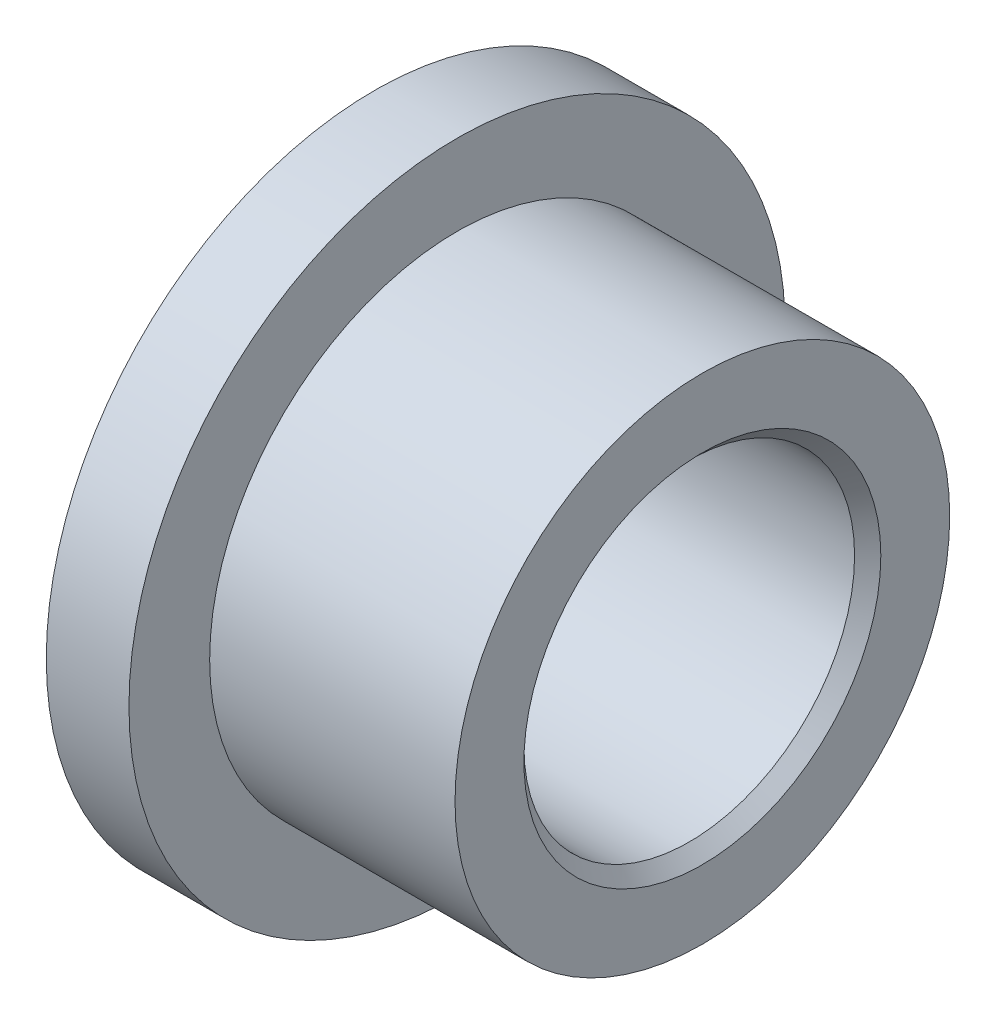
ISO-10303-21;
HEADER;
FILE_DESCRIPTION(('STEP AP214'),'2;1');
FILE_NAME('part.step','',(''),(''),'','','');
FILE_SCHEMA(('AUTOMOTIVE_DESIGN { 1 0 10303 214 1 1 1 1 }'));
ENDSEC;
DATA;
#1=APPLICATION_CONTEXT('core data for automotive mechanical design processes');
#2=APPLICATION_PROTOCOL_DEFINITION('international standard','automotive_design',2000,#1);
#3=PRODUCT_CONTEXT('',#1,'mechanical');
#4=PRODUCT('Part','Part','',(#3));
#5=PRODUCT_RELATED_PRODUCT_CATEGORY('part','',(#4));
#6=PRODUCT_DEFINITION_FORMATION('','',#4);
#7=PRODUCT_DEFINITION_CONTEXT('part definition',#1,'design');
#8=PRODUCT_DEFINITION('design','',#6,#7);
#9=PRODUCT_DEFINITION_SHAPE('','',#8);
#10=(LENGTH_UNIT() NAMED_UNIT(*) SI_UNIT(.MILLI.,.METRE.));
#11=(NAMED_UNIT(*) PLANE_ANGLE_UNIT() SI_UNIT($,.RADIAN.));
#12=(NAMED_UNIT(*) SI_UNIT($,.STERADIAN.) SOLID_ANGLE_UNIT());
#13=UNCERTAINTY_MEASURE_WITH_UNIT(LENGTH_MEASURE(1.E-05),#10,'distance_accuracy_value','');
#14=(GEOMETRIC_REPRESENTATION_CONTEXT(3) GLOBAL_UNCERTAINTY_ASSIGNED_CONTEXT((#13)) GLOBAL_UNIT_ASSIGNED_CONTEXT((#10,
#11,#12)) REPRESENTATION_CONTEXT('',''));
#15=CARTESIAN_POINT('',(0.,0.,0.));
#16=DIRECTION('',(0.,0.,1.));
#17=DIRECTION('',(1.,0.,0.));
#18=AXIS2_PLACEMENT_3D('',#15,#16,#17);
#19=CARTESIAN_POINT('',(4.7498,0.,0.));
#20=DIRECTION('',(1.,0.,0.));
#21=DIRECTION('',(0.,0.,-1.));
#22=AXIS2_PLACEMENT_3D('',#19,#20,#21);
#23=PLANE('',#22);
#24=CARTESIAN_POINT('',(4.7498,0.,0.));
#25=DIRECTION('',(1.,0.,0.));
#26=DIRECTION('',(0.,0.,-1.));
#27=AXIS2_PLACEMENT_3D('',#24,#25,#26);
#28=CIRCLE('',#27,3.4544);
#29=CARTESIAN_POINT('',(4.7498,0.,-3.4544));
#30=VERTEX_POINT('',#29);
#31=EDGE_CURVE('E44',#30,#30,#28,.F.);
#32=ORIENTED_EDGE('',*,*,#31,.T.);
#33=EDGE_LOOP('',(#32));
#34=FACE_BOUND('',#33,.T.);
#35=CARTESIAN_POINT('',(4.7498,0.,0.));
#36=DIRECTION('',(1.,0.,0.));
#37=DIRECTION('',(0.,0.,-1.));
#38=AXIS2_PLACEMENT_3D('',#35,#36,#37);
#39=CIRCLE('',#38,4.7879);
#40=CARTESIAN_POINT('',(4.7498,0.,-4.7879));
#41=VERTEX_POINT('',#40);
#42=EDGE_CURVE('E57',#41,#41,#39,.T.);
#43=ORIENTED_EDGE('',*,*,#42,.T.);
#44=EDGE_LOOP('',(#43));
#45=FACE_BOUND('',#44,.T.);
#46=ADVANCED_FACE('F37',(#34,#45),#23,.T.);
#47=CARTESIAN_POINT('',(4.7498,0.,0.));
#48=DIRECTION('',(-1.,0.,0.));
#49=DIRECTION('',(0.,0.,1.));
#50=AXIS2_PLACEMENT_3D('',#47,#48,#49);
#51=CYLINDRICAL_SURFACE('',#50,4.7879);
#52=ORIENTED_EDGE('',*,*,#42,.F.);
#53=EDGE_LOOP('',(#52));
#54=FACE_BOUND('',#53,.T.);
#55=CARTESIAN_POINT('',(0.,0.,0.));
#56=DIRECTION('',(-1.,0.,0.));
#57=DIRECTION('',(0.,0.,1.));
#58=AXIS2_PLACEMENT_3D('',#55,#56,#57);
#59=CIRCLE('',#58,4.7879);
#60=CARTESIAN_POINT('',(0.,0.,4.7879));
#61=VERTEX_POINT('',#60);
#62=EDGE_CURVE('E60',#61,#61,#59,.T.);
#63=ORIENTED_EDGE('',*,*,#62,.F.);
#64=EDGE_LOOP('',(#63));
#65=FACE_BOUND('',#64,.T.);
#66=ADVANCED_FACE('F86',(#54,#65),#51,.T.);
#67=CARTESIAN_POINT('',(4.7498,0.,0.));
#68=DIRECTION('',(-1.,0.,0.));
#69=DIRECTION('',(0.,0.,1.));
#70=AXIS2_PLACEMENT_3D('',#67,#68,#69);
#71=CYLINDRICAL_SURFACE('',#70,3.2004);
#72=CARTESIAN_POINT('',(4.4958,0.,0.));
#73=DIRECTION('',(1.,0.,0.));
#74=DIRECTION('',(0.,0.,-1.));
#75=AXIS2_PLACEMENT_3D('',#72,#73,#74);
#76=CIRCLE('',#75,3.2004);
#77=CARTESIAN_POINT('',(4.4958,0.,-3.2004));
#78=VERTEX_POINT('',#77);
#79=EDGE_CURVE('E48',#78,#78,#76,.T.);
#80=ORIENTED_EDGE('',*,*,#79,.T.);
#81=EDGE_LOOP('',(#80));
#82=FACE_BOUND('',#81,.T.);
#83=CARTESIAN_POINT('',(-1.3462,0.,0.));
#84=DIRECTION('',(-1.,0.,0.));
#85=DIRECTION('',(0.,0.,1.));
#86=AXIS2_PLACEMENT_3D('',#83,#84,#85);
#87=CIRCLE('',#86,3.2004);
#88=CARTESIAN_POINT('',(-1.3462,0.,3.2004));
#89=VERTEX_POINT('',#88);
#90=EDGE_CURVE('E52',#89,#89,#87,.T.);
#91=ORIENTED_EDGE('',*,*,#90,.T.);
#92=EDGE_LOOP('',(#91));
#93=FACE_BOUND('',#92,.T.);
#94=ADVANCED_FACE('F82',(#82,#93),#71,.F.);
#95=CARTESIAN_POINT('',(0.,0.,0.));
#96=DIRECTION('',(-1.,0.,0.));
#97=DIRECTION('',(0.,0.,1.));
#98=AXIS2_PLACEMENT_3D('',#95,#96,#97);
#99=PLANE('',#98);
#100=CARTESIAN_POINT('',(0.,0.,0.));
#101=DIRECTION('',(-1.,0.,0.));
#102=DIRECTION('',(0.,0.,1.));
#103=AXIS2_PLACEMENT_3D('',#100,#101,#102);
#104=CIRCLE('',#103,6.35);
#105=CARTESIAN_POINT('',(0.,0.,6.35));
#106=VERTEX_POINT('',#105);
#107=EDGE_CURVE('E64',#106,#106,#104,.T.);
#108=ORIENTED_EDGE('',*,*,#107,.F.);
#109=EDGE_LOOP('',(#108));
#110=FACE_BOUND('',#109,.T.);
#111=ORIENTED_EDGE('',*,*,#62,.T.);
#112=EDGE_LOOP('',(#111));
#113=FACE_BOUND('',#112,.T.);
#114=ADVANCED_FACE('F79',(#110,#113),#99,.F.);
#115=CARTESIAN_POINT('',(-1.6002,0.,0.));
#116=DIRECTION('',(-1.,0.,0.));
#117=DIRECTION('',(0.,0.,1.));
#118=AXIS2_PLACEMENT_3D('',#115,#116,#117);
#119=PLANE('',#118);
#120=CARTESIAN_POINT('',(-1.6002,0.,0.));
#121=DIRECTION('',(-1.,0.,0.));
#122=DIRECTION('',(0.,0.,1.));
#123=AXIS2_PLACEMENT_3D('',#120,#121,#122);
#124=CIRCLE('',#123,3.4544);
#125=CARTESIAN_POINT('',(-1.6002,0.,3.4544));
#126=VERTEX_POINT('',#125);
#127=EDGE_CURVE('E10',#126,#126,#124,.F.);
#128=ORIENTED_EDGE('',*,*,#127,.T.);
#129=EDGE_LOOP('',(#128));
#130=FACE_BOUND('',#129,.T.);
#131=CARTESIAN_POINT('',(-1.6002,0.,0.));
#132=DIRECTION('',(-1.,0.,0.));
#133=DIRECTION('',(0.,0.,1.));
#134=AXIS2_PLACEMENT_3D('',#131,#132,#133);
#135=CIRCLE('',#134,6.35);
#136=CARTESIAN_POINT('',(-1.6002,0.,6.35));
#137=VERTEX_POINT('',#136);
#138=EDGE_CURVE('E63',#137,#137,#135,.T.);
#139=ORIENTED_EDGE('',*,*,#138,.T.);
#140=EDGE_LOOP('',(#139));
#141=FACE_BOUND('',#140,.T.);
#142=ADVANCED_FACE('F70',(#130,#141),#119,.T.);
#143=CARTESIAN_POINT('',(-1.6002,0.,0.));
#144=DIRECTION('',(1.,0.,0.));
#145=DIRECTION('',(0.,0.,-1.));
#146=AXIS2_PLACEMENT_3D('',#143,#144,#145);
#147=CYLINDRICAL_SURFACE('',#146,6.35);
#148=ORIENTED_EDGE('',*,*,#138,.F.);
#149=EDGE_LOOP('',(#148));
#150=FACE_BOUND('',#149,.T.);
#151=ORIENTED_EDGE('',*,*,#107,.T.);
#152=EDGE_LOOP('',(#151));
#153=FACE_BOUND('',#152,.T.);
#154=ADVANCED_FACE('F72',(#150,#153),#147,.T.);
#155=CARTESIAN_POINT('',(4.4958,0.,0.));
#156=DIRECTION('',(1.,0.,0.));
#157=DIRECTION('',(0.,0.,-1.));
#158=AXIS2_PLACEMENT_3D('',#155,#156,#157);
#159=CONICAL_SURFACE('',#158,3.2004,0.785398163397447);
#160=ORIENTED_EDGE('',*,*,#31,.F.);
#161=EDGE_LOOP('',(#160));
#162=FACE_BOUND('',#161,.T.);
#163=ORIENTED_EDGE('',*,*,#79,.F.);
#164=EDGE_LOOP('',(#163));
#165=FACE_BOUND('',#164,.T.);
#166=ADVANCED_FACE('F75',(#162,#165),#159,.F.);
#167=CARTESIAN_POINT('',(-1.3462,0.,0.));
#168=DIRECTION('',(-1.,0.,0.));
#169=DIRECTION('',(0.,0.,1.));
#170=AXIS2_PLACEMENT_3D('',#167,#168,#169);
#171=CONICAL_SURFACE('',#170,3.2004,0.785398163397455);
#172=ORIENTED_EDGE('',*,*,#127,.F.);
#173=EDGE_LOOP('',(#172));
#174=FACE_BOUND('',#173,.T.);
#175=ORIENTED_EDGE('',*,*,#90,.F.);
#176=EDGE_LOOP('',(#175));
#177=FACE_BOUND('',#176,.T.);
#178=ADVANCED_FACE('F39',(#174,#177),#171,.F.);
#179=CLOSED_SHELL('',(#46,#66,#94,#114,#142,#154,#166,#178));
#180=MANIFOLD_SOLID_BREP('B2',#179);
#181=ADVANCED_BREP_SHAPE_REPRESENTATION('',(#18,#180),#14);
#182=SHAPE_DEFINITION_REPRESENTATION(#9,#181);
ENDSEC;
END-ISO-10303-21;
